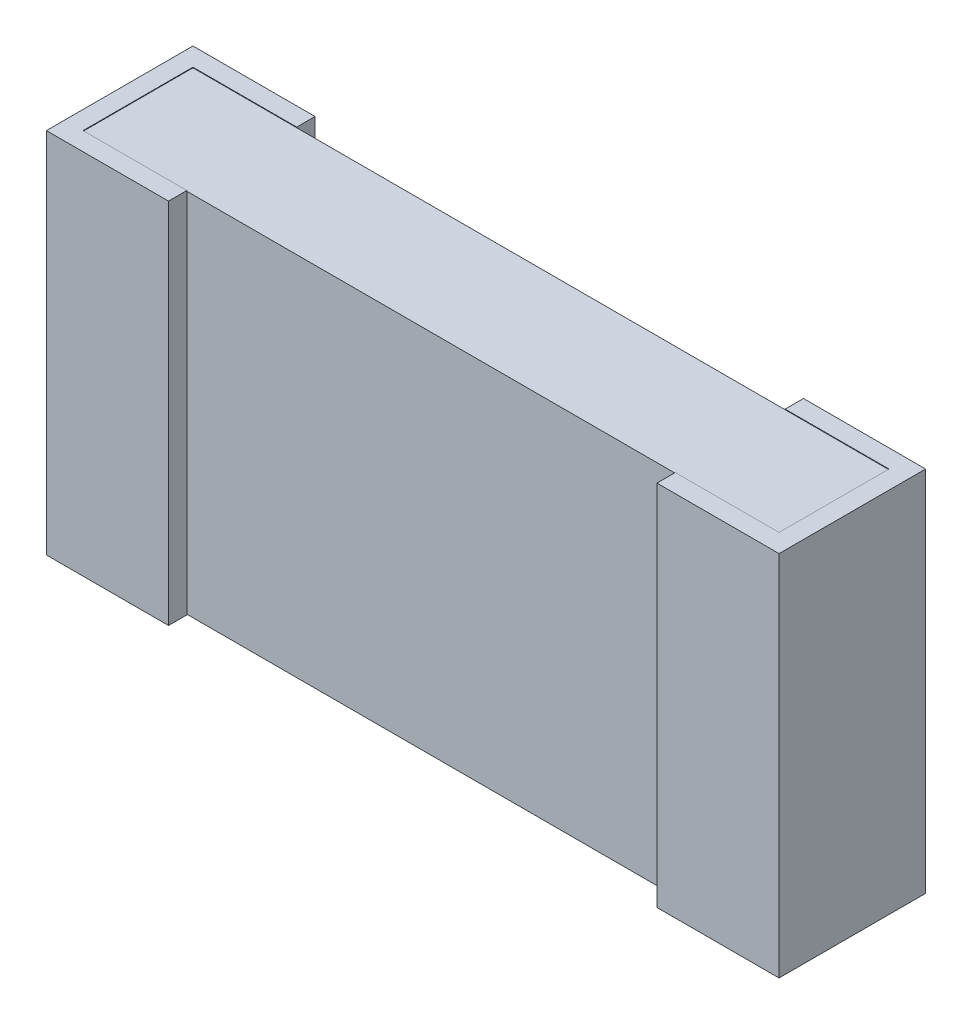
ISO-10303-21;
HEADER;
FILE_DESCRIPTION(('STEP AP214'),'2;1');
FILE_NAME('part.step','',(''),(''),'','','');
FILE_SCHEMA(('AUTOMOTIVE_DESIGN { 1 0 10303 214 1 1 1 1 }'));
ENDSEC;
DATA;
#1=APPLICATION_CONTEXT('core data for automotive mechanical design processes');
#2=APPLICATION_PROTOCOL_DEFINITION('international standard','automotive_design',2000,#1);
#3=PRODUCT_CONTEXT('',#1,'mechanical');
#4=PRODUCT('Part','Part','',(#3));
#5=PRODUCT_RELATED_PRODUCT_CATEGORY('part','',(#4));
#6=PRODUCT_DEFINITION_FORMATION('','',#4);
#7=PRODUCT_DEFINITION_CONTEXT('part definition',#1,'design');
#8=PRODUCT_DEFINITION('design','',#6,#7);
#9=PRODUCT_DEFINITION_SHAPE('','',#8);
#10=(LENGTH_UNIT() NAMED_UNIT(*) SI_UNIT(.MILLI.,.METRE.));
#11=(NAMED_UNIT(*) PLANE_ANGLE_UNIT() SI_UNIT($,.RADIAN.));
#12=(NAMED_UNIT(*) SI_UNIT($,.STERADIAN.) SOLID_ANGLE_UNIT());
#13=UNCERTAINTY_MEASURE_WITH_UNIT(LENGTH_MEASURE(1.E-05),#10,'distance_accuracy_value','');
#14=(GEOMETRIC_REPRESENTATION_CONTEXT(3) GLOBAL_UNCERTAINTY_ASSIGNED_CONTEXT((#13)) GLOBAL_UNIT_ASSIGNED_CONTEXT((#10,
#11,#12)) REPRESENTATION_CONTEXT('',''));
#15=CARTESIAN_POINT('',(0.,0.,0.));
#16=DIRECTION('',(0.,0.,1.));
#17=DIRECTION('',(1.,0.,0.));
#18=AXIS2_PLACEMENT_3D('',#15,#16,#17);
#19=CARTESIAN_POINT('',(0.0762,0.762,0.533400000000122));
#20=DIRECTION('',(0.,0.,-1.));
#21=DIRECTION('',(-1.,0.,0.));
#22=AXIS2_PLACEMENT_3D('',#19,#20,#21);
#23=PLANE('',#22);
#24=DIRECTION('',(0.,1.,0.));
#25=VECTOR('',#24,1.);
#26=CARTESIAN_POINT('',(2.54000000000002,-0.76454,0.533400000000122));
#27=LINE('',#26,#25);
#28=CARTESIAN_POINT('',(2.54000000000001,-0.762,0.533400000000122));
#29=VERTEX_POINT('',#28);
#30=CARTESIAN_POINT('',(2.54000000000001,0.762,0.533400000000122));
#31=VERTEX_POINT('',#30);
#32=EDGE_CURVE('E53',#29,#31,#27,.T.);
#33=ORIENTED_EDGE('',*,*,#32,.T.);
#34=DIRECTION('',(1.,0.,0.));
#35=VECTOR('',#34,1.);
#36=CARTESIAN_POINT('',(0.0762,0.762,0.533400000000122));
#37=LINE('',#36,#35);
#38=CARTESIAN_POINT('',(0.507999999999976,0.762,0.533400000000122));
#39=VERTEX_POINT('',#38);
#40=EDGE_CURVE('E38',#39,#31,#37,.T.);
#41=ORIENTED_EDGE('',*,*,#40,.F.);
#42=DIRECTION('',(0.,1.,0.));
#43=VECTOR('',#42,1.);
#44=CARTESIAN_POINT('',(0.507999999999976,-0.76454,0.533400000000122));
#45=LINE('',#44,#43);
#46=CARTESIAN_POINT('',(0.507999999999976,-0.762,0.533400000000122));
#47=VERTEX_POINT('',#46);
#48=EDGE_CURVE('E349',#47,#39,#45,.T.);
#49=ORIENTED_EDGE('',*,*,#48,.F.);
#50=DIRECTION('',(1.,0.,0.));
#51=VECTOR('',#50,1.);
#52=CARTESIAN_POINT('',(0.0762,-0.762,0.533400000000122));
#53=LINE('',#52,#51);
#54=EDGE_CURVE('E366',#47,#29,#53,.T.);
#55=ORIENTED_EDGE('',*,*,#54,.T.);
#56=EDGE_LOOP('',(#33,#41,#49,#55));
#57=FACE_BOUND('',#56,.T.);
#58=ADVANCED_FACE('F30',(#57),#23,.F.);
#59=CARTESIAN_POINT('',(2.9718,0.762,0.0762000000001228));
#60=DIRECTION('',(0.,0.,1.));
#61=DIRECTION('',(1.,0.,0.));
#62=AXIS2_PLACEMENT_3D('',#59,#60,#61);
#63=PLANE('',#62);
#64=DIRECTION('',(0.,1.,0.));
#65=VECTOR('',#64,1.);
#66=CARTESIAN_POINT('',(2.54,-0.76454,0.0762000000001224));
#67=LINE('',#66,#65);
#68=CARTESIAN_POINT('',(2.54,-0.762,0.0762000000001224));
#69=VERTEX_POINT('',#68);
#70=CARTESIAN_POINT('',(2.54000000000001,0.762,0.0762000000001224));
#71=VERTEX_POINT('',#70);
#72=EDGE_CURVE('E273',#69,#71,#67,.T.);
#73=ORIENTED_EDGE('',*,*,#72,.F.);
#74=DIRECTION('',(-1.,0.,0.));
#75=VECTOR('',#74,1.);
#76=CARTESIAN_POINT('',(2.9718,-0.762,0.0762000000001228));
#77=LINE('',#76,#75);
#78=CARTESIAN_POINT('',(0.508,-0.762,0.0762000000001224));
#79=VERTEX_POINT('',#78);
#80=EDGE_CURVE('E360',#69,#79,#77,.T.);
#81=ORIENTED_EDGE('',*,*,#80,.T.);
#82=DIRECTION('',(0.,1.,0.));
#83=VECTOR('',#82,1.);
#84=CARTESIAN_POINT('',(0.508,-0.76454,0.0762000000001224));
#85=LINE('',#84,#83);
#86=CARTESIAN_POINT('',(0.508,0.762,0.0762000000001224));
#87=VERTEX_POINT('',#86);
#88=EDGE_CURVE('E336',#79,#87,#85,.T.);
#89=ORIENTED_EDGE('',*,*,#88,.T.);
#90=DIRECTION('',(-1.,0.,0.));
#91=VECTOR('',#90,1.);
#92=CARTESIAN_POINT('',(2.9718,0.762,0.0762000000001228));
#93=LINE('',#92,#91);
#94=EDGE_CURVE('E45',#71,#87,#93,.T.);
#95=ORIENTED_EDGE('',*,*,#94,.F.);
#96=EDGE_LOOP('',(#73,#81,#89,#95));
#97=FACE_BOUND('',#96,.T.);
#98=ADVANCED_FACE('F32',(#97),#63,.F.);
#99=CARTESIAN_POINT('',(0.0762000000000002,0.762,0.0762000000001225));
#100=DIRECTION('',(0.,1.,0.));
#101=DIRECTION('',(0.,0.,1.));
#102=AXIS2_PLACEMENT_3D('',#99,#100,#101);
#103=PLANE('',#102);
#104=DIRECTION('',(0.,0.,-1.));
#105=VECTOR('',#104,1.);
#106=CARTESIAN_POINT('',(0.0762,0.762,0.533400000000122));
#107=LINE('',#106,#105);
#108=CARTESIAN_POINT('',(0.0762,0.762,0.533400000000122));
#109=VERTEX_POINT('',#108);
#110=CARTESIAN_POINT('',(0.0762000000000002,0.762,0.0762000000001224));
#111=VERTEX_POINT('',#110);
#112=EDGE_CURVE('E365',#109,#111,#107,.T.);
#113=ORIENTED_EDGE('',*,*,#112,.F.);
#114=EDGE_CURVE('E11',#109,#39,#37,.T.);
#115=ORIENTED_EDGE('',*,*,#114,.T.);
#116=ORIENTED_EDGE('',*,*,#40,.T.);
#117=DIRECTION('',(-1.,0.,0.));
#118=VECTOR('',#117,1.);
#119=CARTESIAN_POINT('',(0.0762000000000002,0.762,0.533400000000122));
#120=LINE('',#119,#118);
#121=CARTESIAN_POINT('',(2.9718,0.762,0.533400000000122));
#122=VERTEX_POINT('',#121);
#123=EDGE_CURVE('E277',#122,#31,#120,.T.);
#124=ORIENTED_EDGE('',*,*,#123,.F.);
#125=DIRECTION('',(0.,0.,1.));
#126=VECTOR('',#125,1.);
#127=CARTESIAN_POINT('',(2.9718,0.762,0.0762000000001228));
#128=LINE('',#127,#126);
#129=CARTESIAN_POINT('',(2.9718,0.762,0.0762000000001228));
#130=VERTEX_POINT('',#129);
#131=EDGE_CURVE('E202',#130,#122,#128,.T.);
#132=ORIENTED_EDGE('',*,*,#131,.F.);
#133=EDGE_CURVE('E368',#130,#71,#93,.T.);
#134=ORIENTED_EDGE('',*,*,#133,.T.);
#135=ORIENTED_EDGE('',*,*,#94,.T.);
#136=DIRECTION('',(-1.,0.,0.));
#137=VECTOR('',#136,1.);
#138=CARTESIAN_POINT('',(0.0762000000000002,0.762,0.0762000000001224));
#139=LINE('',#138,#137);
#140=EDGE_CURVE('E348',#87,#111,#139,.T.);
#141=ORIENTED_EDGE('',*,*,#140,.T.);
#142=EDGE_LOOP('',(#113,#115,#116,#124,#132,#134,#135,#141));
#143=FACE_BOUND('',#142,.T.);
#144=ADVANCED_FACE('F371',(#143),#103,.T.);
#145=CARTESIAN_POINT('',(0.0762000000000002,-0.762,0.0762000000001225));
#146=DIRECTION('',(0.,1.,0.));
#147=DIRECTION('',(0.,0.,1.));
#148=AXIS2_PLACEMENT_3D('',#145,#146,#147);
#149=PLANE('',#148);
#150=DIRECTION('',(0.,0.,-1.));
#151=VECTOR('',#150,1.);
#152=CARTESIAN_POINT('',(0.0762,-0.762,0.533400000000122));
#153=LINE('',#152,#151);
#154=CARTESIAN_POINT('',(0.0762,-0.762,0.533400000000122));
#155=VERTEX_POINT('',#154);
#156=CARTESIAN_POINT('',(0.0762000000000002,-0.762,0.0762000000001225));
#157=VERTEX_POINT('',#156);
#158=EDGE_CURVE('E352',#155,#157,#153,.T.);
#159=ORIENTED_EDGE('',*,*,#158,.T.);
#160=EDGE_CURVE('E355',#79,#157,#77,.T.);
#161=ORIENTED_EDGE('',*,*,#160,.F.);
#162=ORIENTED_EDGE('',*,*,#80,.F.);
#163=CARTESIAN_POINT('',(2.9718,-0.762,0.0762000000001228));
#164=VERTEX_POINT('',#163);
#165=EDGE_CURVE('E356',#164,#69,#77,.T.);
#166=ORIENTED_EDGE('',*,*,#165,.F.);
#167=DIRECTION('',(0.,0.,1.));
#168=VECTOR('',#167,1.);
#169=CARTESIAN_POINT('',(2.9718,-0.762,0.0762000000001228));
#170=LINE('',#169,#168);
#171=CARTESIAN_POINT('',(2.9718,-0.762,0.533400000000122));
#172=VERTEX_POINT('',#171);
#173=EDGE_CURVE('E359',#164,#172,#170,.T.);
#174=ORIENTED_EDGE('',*,*,#173,.T.);
#175=EDGE_CURVE('E362',#29,#172,#53,.T.);
#176=ORIENTED_EDGE('',*,*,#175,.F.);
#177=ORIENTED_EDGE('',*,*,#54,.F.);
#178=EDGE_CURVE('E363',#155,#47,#53,.T.);
#179=ORIENTED_EDGE('',*,*,#178,.F.);
#180=EDGE_LOOP('',(#159,#161,#162,#166,#174,#176,#177,#179));
#181=FACE_BOUND('',#180,.T.);
#182=ADVANCED_FACE('F418',(#181),#149,.F.);
#183=CARTESIAN_POINT('',(0.0762,-0.76454,0.533400000000122));
#184=DIRECTION('',(0.,0.,1.));
#185=DIRECTION('',(1.,0.,0.));
#186=AXIS2_PLACEMENT_3D('',#183,#184,#185);
#187=PLANE('',#186);
#188=DIRECTION('',(0.,1.,0.));
#189=VECTOR('',#188,1.);
#190=CARTESIAN_POINT('',(0.0762,-0.76454,0.533400000000122));
#191=LINE('',#190,#189);
#192=CARTESIAN_POINT('',(0.0762,-0.76454,0.533400000000122));
#193=VERTEX_POINT('',#192);
#194=EDGE_CURVE('E325',#193,#155,#191,.T.);
#195=ORIENTED_EDGE('',*,*,#194,.T.);
#196=ORIENTED_EDGE('',*,*,#178,.T.);
#197=CARTESIAN_POINT('',(0.507999999999976,-0.76454,0.533400000000122));
#198=VERTEX_POINT('',#197);
#199=EDGE_CURVE('E345',#198,#47,#45,.T.);
#200=ORIENTED_EDGE('',*,*,#199,.F.);
#201=DIRECTION('',(1.,0.,0.));
#202=VECTOR('',#201,1.);
#203=CARTESIAN_POINT('',(0.0762,-0.76454,0.533400000000122));
#204=LINE('',#203,#202);
#205=EDGE_CURVE('E303',#193,#198,#204,.T.);
#206=ORIENTED_EDGE('',*,*,#205,.F.);
#207=EDGE_LOOP('',(#195,#196,#200,#206));
#208=FACE_BOUND('',#207,.T.);
#209=ADVANCED_FACE('F425',(#208),#187,.F.);
#210=CARTESIAN_POINT('',(0.508,-0.76454,0.0762000000001224));
#211=DIRECTION('',(0.,0.,-1.));
#212=DIRECTION('',(-1.,0.,0.));
#213=AXIS2_PLACEMENT_3D('',#210,#211,#212);
#214=PLANE('',#213);
#215=CARTESIAN_POINT('',(0.508,-0.76454,0.0762000000001224));
#216=VERTEX_POINT('',#215);
#217=EDGE_CURVE('E332',#216,#79,#85,.T.);
#218=ORIENTED_EDGE('',*,*,#217,.T.);
#219=ORIENTED_EDGE('',*,*,#160,.T.);
#220=DIRECTION('',(0.,1.,0.));
#221=VECTOR('',#220,1.);
#222=CARTESIAN_POINT('',(0.0762000000000002,-0.76454,0.0762000000001224));
#223=LINE('',#222,#221);
#224=CARTESIAN_POINT('',(0.0762000000000002,-0.76454,0.0762000000001224));
#225=VERTEX_POINT('',#224);
#226=EDGE_CURVE('E329',#225,#157,#223,.T.);
#227=ORIENTED_EDGE('',*,*,#226,.F.);
#228=DIRECTION('',(-1.,0.,0.));
#229=VECTOR('',#228,1.);
#230=CARTESIAN_POINT('',(0.508,-0.76454,0.0762000000001224));
#231=LINE('',#230,#229);
#232=EDGE_CURVE('E320',#216,#225,#231,.T.);
#233=ORIENTED_EDGE('',*,*,#232,.F.);
#234=EDGE_LOOP('',(#218,#219,#227,#233));
#235=FACE_BOUND('',#234,.T.);
#236=ADVANCED_FACE('F414',(#235),#214,.F.);
#237=CARTESIAN_POINT('',(0.0762000000000002,-0.76454,0.0762000000001224));
#238=DIRECTION('',(-1.,0.,0.));
#239=DIRECTION('',(0.,0.,1.));
#240=AXIS2_PLACEMENT_3D('',#237,#238,#239);
#241=PLANE('',#240);
#242=ORIENTED_EDGE('',*,*,#226,.T.);
#243=ORIENTED_EDGE('',*,*,#158,.F.);
#244=ORIENTED_EDGE('',*,*,#194,.F.);
#245=DIRECTION('',(0.,0.,1.));
#246=VECTOR('',#245,1.);
#247=CARTESIAN_POINT('',(0.0762000000000002,-0.76454,0.0762000000001224));
#248=LINE('',#247,#246);
#249=EDGE_CURVE('E322',#225,#193,#248,.T.);
#250=ORIENTED_EDGE('',*,*,#249,.F.);
#251=EDGE_LOOP('',(#242,#243,#244,#250));
#252=FACE_BOUND('',#251,.T.);
#253=ADVANCED_FACE('F422',(#252),#241,.F.);
#254=ORIENTED_EDGE('',*,*,#114,.F.);
#255=CARTESIAN_POINT('',(0.0762,0.76454,0.533400000000122));
#256=VERTEX_POINT('',#255);
#257=EDGE_CURVE('E324',#109,#256,#191,.T.);
#258=ORIENTED_EDGE('',*,*,#257,.T.);
#259=DIRECTION('',(1.,0.,0.));
#260=VECTOR('',#259,1.);
#261=CARTESIAN_POINT('',(0.0762,0.76454,0.533400000000122));
#262=LINE('',#261,#260);
#263=CARTESIAN_POINT('',(0.507999999999976,0.76454,0.533400000000122));
#264=VERTEX_POINT('',#263);
#265=EDGE_CURVE('E279',#256,#264,#262,.T.);
#266=ORIENTED_EDGE('',*,*,#265,.T.);
#267=EDGE_CURVE('E344',#39,#264,#45,.T.);
#268=ORIENTED_EDGE('',*,*,#267,.F.);
#269=EDGE_LOOP('',(#254,#258,#266,#268));
#270=FACE_BOUND('',#269,.T.);
#271=ADVANCED_FACE('F446',(#270),#187,.F.);
#272=CARTESIAN_POINT('',(0.508,-0.76454,0.609599999999878));
#273=DIRECTION('',(1.,0.,-3.08755736784921E-13));
#274=DIRECTION('',(-3.08755736784921E-13,0.,-1.));
#275=AXIS2_PLACEMENT_3D('',#272,#273,#274);
#276=PLANE('',#275);
#277=DIRECTION('',(-3.08755736784921E-13,0.,-1.));
#278=VECTOR('',#277,1.);
#279=CARTESIAN_POINT('',(0.508,0.76454,0.609599999999878));
#280=LINE('',#279,#278);
#281=CARTESIAN_POINT('',(0.508,0.76454,0.609599999999878));
#282=VERTEX_POINT('',#281);
#283=EDGE_CURVE('E282',#282,#264,#280,.T.);
#284=ORIENTED_EDGE('',*,*,#283,.F.);
#285=DIRECTION('',(0.,1.,0.));
#286=VECTOR('',#285,1.);
#287=CARTESIAN_POINT('',(0.508,-0.76454,0.609599999999878));
#288=LINE('',#287,#286);
#289=CARTESIAN_POINT('',(0.508,-0.76454,0.609599999999878));
#290=VERTEX_POINT('',#289);
#291=EDGE_CURVE('E342',#290,#282,#288,.T.);
#292=ORIENTED_EDGE('',*,*,#291,.F.);
#293=DIRECTION('',(-3.08755736784921E-13,0.,-1.));
#294=VECTOR('',#293,1.);
#295=CARTESIAN_POINT('',(0.508,-0.76454,0.609599999999878));
#296=LINE('',#295,#294);
#297=EDGE_CURVE('E305',#290,#198,#296,.T.);
#298=ORIENTED_EDGE('',*,*,#297,.T.);
#299=ORIENTED_EDGE('',*,*,#199,.T.);
#300=ORIENTED_EDGE('',*,*,#48,.T.);
#301=ORIENTED_EDGE('',*,*,#267,.T.);
#302=EDGE_LOOP('',(#284,#292,#298,#299,#300,#301));
#303=FACE_BOUND('',#302,.T.);
#304=ADVANCED_FACE('F450',(#303),#276,.T.);
#305=CARTESIAN_POINT('',(0.,-0.76454,0.609599999999878));
#306=DIRECTION('',(0.,0.,1.));
#307=DIRECTION('',(1.,0.,0.));
#308=AXIS2_PLACEMENT_3D('',#305,#306,#307);
#309=PLANE('',#308);
#310=DIRECTION('',(1.,0.,0.));
#311=VECTOR('',#310,1.);
#312=CARTESIAN_POINT('',(0.,0.76454,0.609599999999878));
#313=LINE('',#312,#311);
#314=CARTESIAN_POINT('',(0.,0.76454,0.609599999999878));
#315=VERTEX_POINT('',#314);
#316=EDGE_CURVE('E285',#315,#282,#313,.T.);
#317=ORIENTED_EDGE('',*,*,#316,.F.);
#318=DIRECTION('',(0.,1.,0.));
#319=VECTOR('',#318,1.);
#320=CARTESIAN_POINT('',(0.,-0.76454,0.609599999999878));
#321=LINE('',#320,#319);
#322=CARTESIAN_POINT('',(0.,-0.76454,0.609599999999878));
#323=VERTEX_POINT('',#322);
#324=EDGE_CURVE('E340',#323,#315,#321,.T.);
#325=ORIENTED_EDGE('',*,*,#324,.F.);
#326=DIRECTION('',(1.,0.,0.));
#327=VECTOR('',#326,1.);
#328=CARTESIAN_POINT('',(0.,-0.76454,0.609599999999878));
#329=LINE('',#328,#327);
#330=EDGE_CURVE('E308',#323,#290,#329,.T.);
#331=ORIENTED_EDGE('',*,*,#330,.T.);
#332=ORIENTED_EDGE('',*,*,#291,.T.);
#333=EDGE_LOOP('',(#317,#325,#331,#332));
#334=FACE_BOUND('',#333,.T.);
#335=ADVANCED_FACE('F487',(#334),#309,.T.);
#336=CARTESIAN_POINT('',(0.,-0.76454,0.));
#337=DIRECTION('',(-1.,0.,0.));
#338=DIRECTION('',(0.,0.,1.));
#339=AXIS2_PLACEMENT_3D('',#336,#337,#338);
#340=PLANE('',#339);
#341=DIRECTION('',(0.,0.,1.));
#342=VECTOR('',#341,1.);
#343=CARTESIAN_POINT('',(0.,0.76454,0.));
#344=LINE('',#343,#342);
#345=CARTESIAN_POINT('',(0.,0.76454,0.));
#346=VERTEX_POINT('',#345);
#347=EDGE_CURVE('E288',#346,#315,#344,.T.);
#348=ORIENTED_EDGE('',*,*,#347,.F.);
#349=DIRECTION('',(0.,1.,0.));
#350=VECTOR('',#349,1.);
#351=CARTESIAN_POINT('',(0.,-0.76454,0.));
#352=LINE('',#351,#350);
#353=CARTESIAN_POINT('',(0.,-0.76454,0.));
#354=VERTEX_POINT('',#353);
#355=EDGE_CURVE('E338',#354,#346,#352,.T.);
#356=ORIENTED_EDGE('',*,*,#355,.F.);
#357=DIRECTION('',(0.,0.,1.));
#358=VECTOR('',#357,1.);
#359=CARTESIAN_POINT('',(0.,-0.76454,0.));
#360=LINE('',#359,#358);
#361=EDGE_CURVE('E311',#354,#323,#360,.T.);
#362=ORIENTED_EDGE('',*,*,#361,.T.);
#363=ORIENTED_EDGE('',*,*,#324,.T.);
#364=EDGE_LOOP('',(#348,#356,#362,#363));
#365=FACE_BOUND('',#364,.T.);
#366=ADVANCED_FACE('F490',(#365),#340,.T.);
#367=CARTESIAN_POINT('',(0.507999999999976,-0.76454,0.));
#368=DIRECTION('',(0.,0.,-1.));
#369=DIRECTION('',(-1.,0.,0.));
#370=AXIS2_PLACEMENT_3D('',#367,#368,#369);
#371=PLANE('',#370);
#372=DIRECTION('',(-1.,0.,0.));
#373=VECTOR('',#372,1.);
#374=CARTESIAN_POINT('',(0.507999999999976,0.76454,0.));
#375=LINE('',#374,#373);
#376=CARTESIAN_POINT('',(0.507999999999976,0.76454,0.));
#377=VERTEX_POINT('',#376);
#378=EDGE_CURVE('E291',#377,#346,#375,.T.);
#379=ORIENTED_EDGE('',*,*,#378,.F.);
#380=DIRECTION('',(0.,1.,0.));
#381=VECTOR('',#380,1.);
#382=CARTESIAN_POINT('',(0.507999999999976,-0.76454,0.));
#383=LINE('',#382,#381);
#384=CARTESIAN_POINT('',(0.507999999999976,-0.76454,0.));
#385=VERTEX_POINT('',#384);
#386=EDGE_CURVE('E335',#385,#377,#383,.T.);
#387=ORIENTED_EDGE('',*,*,#386,.F.);
#388=DIRECTION('',(-1.,0.,0.));
#389=VECTOR('',#388,1.);
#390=CARTESIAN_POINT('',(0.507999999999976,-0.76454,0.));
#391=LINE('',#390,#389);
#392=EDGE_CURVE('E314',#385,#354,#391,.T.);
#393=ORIENTED_EDGE('',*,*,#392,.T.);
#394=ORIENTED_EDGE('',*,*,#355,.T.);
#395=EDGE_LOOP('',(#379,#387,#393,#394));
#396=FACE_BOUND('',#395,.T.);
#397=ADVANCED_FACE('F436',(#396),#371,.T.);
#398=CARTESIAN_POINT('',(0.508,-0.76454,0.0762000000001224));
#399=DIRECTION('',(1.,0.,-3.10178574280132E-13));
#400=DIRECTION('',(-3.10178574280132E-13,0.,-1.));
#401=AXIS2_PLACEMENT_3D('',#398,#399,#400);
#402=PLANE('',#401);
#403=DIRECTION('',(-3.10178574280132E-13,0.,-1.));
#404=VECTOR('',#403,1.);
#405=CARTESIAN_POINT('',(0.508,0.76454,0.0762000000001224));
#406=LINE('',#405,#404);
#407=CARTESIAN_POINT('',(0.508,0.76454,0.0762000000001224));
#408=VERTEX_POINT('',#407);
#409=EDGE_CURVE('E294',#408,#377,#406,.T.);
#410=ORIENTED_EDGE('',*,*,#409,.F.);
#411=EDGE_CURVE('E331',#87,#408,#85,.T.);
#412=ORIENTED_EDGE('',*,*,#411,.F.);
#413=ORIENTED_EDGE('',*,*,#88,.F.);
#414=ORIENTED_EDGE('',*,*,#217,.F.);
#415=DIRECTION('',(-3.10178574280132E-13,0.,-1.));
#416=VECTOR('',#415,1.);
#417=CARTESIAN_POINT('',(0.508,-0.76454,0.0762000000001224));
#418=LINE('',#417,#416);
#419=EDGE_CURVE('E317',#216,#385,#418,.T.);
#420=ORIENTED_EDGE('',*,*,#419,.T.);
#421=ORIENTED_EDGE('',*,*,#386,.T.);
#422=EDGE_LOOP('',(#410,#412,#413,#414,#420,#421));
#423=FACE_BOUND('',#422,.T.);
#424=ADVANCED_FACE('F408',(#423),#402,.T.);
#425=ORIENTED_EDGE('',*,*,#140,.F.);
#426=ORIENTED_EDGE('',*,*,#411,.T.);
#427=DIRECTION('',(-1.,0.,0.));
#428=VECTOR('',#427,1.);
#429=CARTESIAN_POINT('',(0.508,0.76454,0.0762000000001224));
#430=LINE('',#429,#428);
#431=CARTESIAN_POINT('',(0.0762000000000002,0.76454,0.0762000000001224));
#432=VERTEX_POINT('',#431);
#433=EDGE_CURVE('E297',#408,#432,#430,.T.);
#434=ORIENTED_EDGE('',*,*,#433,.T.);
#435=EDGE_CURVE('E328',#111,#432,#223,.T.);
#436=ORIENTED_EDGE('',*,*,#435,.F.);
#437=EDGE_LOOP('',(#425,#426,#434,#436));
#438=FACE_BOUND('',#437,.T.);
#439=ADVANCED_FACE('F403',(#438),#214,.F.);
#440=ORIENTED_EDGE('',*,*,#112,.T.);
#441=ORIENTED_EDGE('',*,*,#435,.T.);
#442=DIRECTION('',(0.,0.,1.));
#443=VECTOR('',#442,1.);
#444=CARTESIAN_POINT('',(0.0762000000000002,0.76454,0.0762000000001224));
#445=LINE('',#444,#443);
#446=EDGE_CURVE('E300',#432,#256,#445,.T.);
#447=ORIENTED_EDGE('',*,*,#446,.T.);
#448=ORIENTED_EDGE('',*,*,#257,.F.);
#449=EDGE_LOOP('',(#440,#441,#447,#448));
#450=FACE_BOUND('',#449,.T.);
#451=ADVANCED_FACE('F444',(#450),#241,.F.);
#452=CARTESIAN_POINT('',(0.,-0.76454,0.533400000000122));
#453=DIRECTION('',(0.,-1.,0.));
#454=DIRECTION('',(0.,0.,-1.));
#455=AXIS2_PLACEMENT_3D('',#452,#453,#454);
#456=PLANE('',#455);
#457=ORIENTED_EDGE('',*,*,#205,.T.);
#458=ORIENTED_EDGE('',*,*,#297,.F.);
#459=ORIENTED_EDGE('',*,*,#330,.F.);
#460=ORIENTED_EDGE('',*,*,#361,.F.);
#461=ORIENTED_EDGE('',*,*,#392,.F.);
#462=ORIENTED_EDGE('',*,*,#419,.F.);
#463=ORIENTED_EDGE('',*,*,#232,.T.);
#464=ORIENTED_EDGE('',*,*,#249,.T.);
#465=EDGE_LOOP('',(#457,#458,#459,#460,#461,#462,#463,#464));
#466=FACE_BOUND('',#465,.T.);
#467=ADVANCED_FACE('F429',(#466),#456,.T.);
#468=CARTESIAN_POINT('',(0.,0.76454,0.533400000000122));
#469=DIRECTION('',(0.,-1.,0.));
#470=DIRECTION('',(0.,0.,-1.));
#471=AXIS2_PLACEMENT_3D('',#468,#469,#470);
#472=PLANE('',#471);
#473=ORIENTED_EDGE('',*,*,#265,.F.);
#474=ORIENTED_EDGE('',*,*,#446,.F.);
#475=ORIENTED_EDGE('',*,*,#433,.F.);
#476=ORIENTED_EDGE('',*,*,#409,.T.);
#477=ORIENTED_EDGE('',*,*,#378,.T.);
#478=ORIENTED_EDGE('',*,*,#347,.T.);
#479=ORIENTED_EDGE('',*,*,#316,.T.);
#480=ORIENTED_EDGE('',*,*,#283,.T.);
#481=EDGE_LOOP('',(#473,#474,#475,#476,#477,#478,#479,#480));
#482=FACE_BOUND('',#481,.T.);
#483=ADVANCED_FACE('F440',(#482),#472,.F.);
#484=CARTESIAN_POINT('',(2.9718,-0.76454,0.533400000000122));
#485=DIRECTION('',(0.,0.,-1.));
#486=DIRECTION('',(-1.,0.,0.));
#487=AXIS2_PLACEMENT_3D('',#484,#485,#486);
#488=PLANE('',#487);
#489=ORIENTED_EDGE('',*,*,#175,.T.);
#490=DIRECTION('',(0.,1.,0.));
#491=VECTOR('',#490,1.);
#492=CARTESIAN_POINT('',(2.9718,-0.76454,0.533400000000122));
#493=LINE('',#492,#491);
#494=CARTESIAN_POINT('',(2.9718,-0.76454,0.533400000000122));
#495=VERTEX_POINT('',#494);
#496=EDGE_CURVE('E205',#495,#172,#493,.T.);
#497=ORIENTED_EDGE('',*,*,#496,.F.);
#498=DIRECTION('',(-1.,0.,0.));
#499=VECTOR('',#498,1.);
#500=CARTESIAN_POINT('',(2.9718,-0.76454,0.533400000000122));
#501=LINE('',#500,#499);
#502=CARTESIAN_POINT('',(2.54000000000002,-0.76454,0.533400000000122));
#503=VERTEX_POINT('',#502);
#504=EDGE_CURVE('E234',#495,#503,#501,.T.);
#505=ORIENTED_EDGE('',*,*,#504,.T.);
#506=EDGE_CURVE('E253',#503,#29,#27,.T.);
#507=ORIENTED_EDGE('',*,*,#506,.T.);
#508=EDGE_LOOP('',(#489,#497,#505,#507));
#509=FACE_BOUND('',#508,.T.);
#510=ADVANCED_FACE('F453',(#509),#488,.T.);
#511=CARTESIAN_POINT('',(2.9718,-0.76454,0.0762000000001224));
#512=DIRECTION('',(-1.,0.,0.));
#513=DIRECTION('',(0.,0.,1.));
#514=AXIS2_PLACEMENT_3D('',#511,#512,#513);
#515=PLANE('',#514);
#516=ORIENTED_EDGE('',*,*,#173,.F.);
#517=DIRECTION('',(0.,1.,0.));
#518=VECTOR('',#517,1.);
#519=CARTESIAN_POINT('',(2.9718,-0.76454,0.0762000000001224));
#520=LINE('',#519,#518);
#521=CARTESIAN_POINT('',(2.9718,-0.76454,0.0762000000001224));
#522=VERTEX_POINT('',#521);
#523=EDGE_CURVE('E206',#522,#164,#520,.T.);
#524=ORIENTED_EDGE('',*,*,#523,.F.);
#525=DIRECTION('',(0.,0.,1.));
#526=VECTOR('',#525,1.);
#527=CARTESIAN_POINT('',(2.9718,-0.76454,0.0762000000001224));
#528=LINE('',#527,#526);
#529=EDGE_CURVE('E237',#522,#495,#528,.T.);
#530=ORIENTED_EDGE('',*,*,#529,.T.);
#531=ORIENTED_EDGE('',*,*,#496,.T.);
#532=EDGE_LOOP('',(#516,#524,#530,#531));
#533=FACE_BOUND('',#532,.T.);
#534=ADVANCED_FACE('F457',(#533),#515,.T.);
#535=CARTESIAN_POINT('',(2.54,-0.76454,0.0762000000001224));
#536=DIRECTION('',(0.,0.,1.));
#537=DIRECTION('',(1.,0.,0.));
#538=AXIS2_PLACEMENT_3D('',#535,#536,#537);
#539=PLANE('',#538);
#540=ORIENTED_EDGE('',*,*,#165,.T.);
#541=CARTESIAN_POINT('',(2.54,-0.76454,0.0762000000001224));
#542=VERTEX_POINT('',#541);
#543=EDGE_CURVE('E269',#542,#69,#67,.T.);
#544=ORIENTED_EDGE('',*,*,#543,.F.);
#545=DIRECTION('',(1.,0.,0.));
#546=VECTOR('',#545,1.);
#547=CARTESIAN_POINT('',(2.54,-0.76454,0.0762000000001224));
#548=LINE('',#547,#546);
#549=EDGE_CURVE('E240',#542,#522,#548,.T.);
#550=ORIENTED_EDGE('',*,*,#549,.T.);
#551=ORIENTED_EDGE('',*,*,#523,.T.);
#552=EDGE_LOOP('',(#540,#544,#550,#551));
#553=FACE_BOUND('',#552,.T.);
#554=ADVANCED_FACE('F463',(#553),#539,.T.);
#555=CARTESIAN_POINT('',(2.9718,0.76454,0.533400000000122));
#556=VERTEX_POINT('',#555);
#557=EDGE_CURVE('E195',#122,#556,#493,.T.);
#558=ORIENTED_EDGE('',*,*,#557,.F.);
#559=ORIENTED_EDGE('',*,*,#123,.T.);
#560=CARTESIAN_POINT('',(2.54000000000002,0.76454,0.533400000000122));
#561=VERTEX_POINT('',#560);
#562=EDGE_CURVE('E212',#31,#561,#27,.T.);
#563=ORIENTED_EDGE('',*,*,#562,.T.);
#564=DIRECTION('',(-1.,0.,0.));
#565=VECTOR('',#564,1.);
#566=CARTESIAN_POINT('',(2.9718,0.76454,0.533400000000122));
#567=LINE('',#566,#565);
#568=EDGE_CURVE('E209',#556,#561,#567,.T.);
#569=ORIENTED_EDGE('',*,*,#568,.F.);
#570=EDGE_LOOP('',(#558,#559,#563,#569));
#571=FACE_BOUND('',#570,.T.);
#572=ADVANCED_FACE('F210',(#571),#488,.T.);
#573=CARTESIAN_POINT('',(2.9718,0.76454,0.0762000000001224));
#574=VERTEX_POINT('',#573);
#575=EDGE_CURVE('E272',#130,#574,#520,.T.);
#576=ORIENTED_EDGE('',*,*,#575,.F.);
#577=ORIENTED_EDGE('',*,*,#131,.T.);
#578=ORIENTED_EDGE('',*,*,#557,.T.);
#579=DIRECTION('',(0.,0.,1.));
#580=VECTOR('',#579,1.);
#581=CARTESIAN_POINT('',(2.9718,0.76454,0.0762000000001224));
#582=LINE('',#581,#580);
#583=EDGE_CURVE('E200',#574,#556,#582,.T.);
#584=ORIENTED_EDGE('',*,*,#583,.F.);
#585=EDGE_LOOP('',(#576,#577,#578,#584));
#586=FACE_BOUND('',#585,.T.);
#587=ADVANCED_FACE('F198',(#586),#515,.T.);
#588=CARTESIAN_POINT('',(2.54,0.76454,0.0762000000001224));
#589=VERTEX_POINT('',#588);
#590=EDGE_CURVE('E268',#71,#589,#67,.T.);
#591=ORIENTED_EDGE('',*,*,#590,.F.);
#592=ORIENTED_EDGE('',*,*,#133,.F.);
#593=ORIENTED_EDGE('',*,*,#575,.T.);
#594=DIRECTION('',(1.,0.,0.));
#595=VECTOR('',#594,1.);
#596=CARTESIAN_POINT('',(2.54,0.76454,0.0762000000001224));
#597=LINE('',#596,#595);
#598=EDGE_CURVE('E220',#589,#574,#597,.T.);
#599=ORIENTED_EDGE('',*,*,#598,.F.);
#600=EDGE_LOOP('',(#591,#592,#593,#599));
#601=FACE_BOUND('',#600,.T.);
#602=ADVANCED_FACE('F396',(#601),#539,.T.);
#603=CARTESIAN_POINT('',(2.54,-0.76454,0.0762000000001224));
#604=DIRECTION('',(1.,0.,3.10178574280132E-13));
#605=DIRECTION('',(3.10178574280132E-13,0.,-1.));
#606=AXIS2_PLACEMENT_3D('',#603,#604,#605);
#607=PLANE('',#606);
#608=DIRECTION('',(3.10178574280132E-13,0.,-1.));
#609=VECTOR('',#608,1.);
#610=CARTESIAN_POINT('',(2.54,0.76454,0.0762000000001224));
#611=LINE('',#610,#609);
#612=CARTESIAN_POINT('',(2.54000000000002,0.76454,0.));
#613=VERTEX_POINT('',#612);
#614=EDGE_CURVE('E222',#589,#613,#611,.T.);
#615=ORIENTED_EDGE('',*,*,#614,.T.);
#616=DIRECTION('',(0.,1.,0.));
#617=VECTOR('',#616,1.);
#618=CARTESIAN_POINT('',(2.54000000000002,-0.76454,0.));
#619=LINE('',#618,#617);
#620=CARTESIAN_POINT('',(2.54000000000002,-0.76454,0.));
#621=VERTEX_POINT('',#620);
#622=EDGE_CURVE('E265',#621,#613,#619,.T.);
#623=ORIENTED_EDGE('',*,*,#622,.F.);
#624=DIRECTION('',(3.10178574280132E-13,0.,-1.));
#625=VECTOR('',#624,1.);
#626=CARTESIAN_POINT('',(2.54,-0.76454,0.0762000000001224));
#627=LINE('',#626,#625);
#628=EDGE_CURVE('E243',#542,#621,#627,.T.);
#629=ORIENTED_EDGE('',*,*,#628,.F.);
#630=ORIENTED_EDGE('',*,*,#543,.T.);
#631=ORIENTED_EDGE('',*,*,#72,.T.);
#632=ORIENTED_EDGE('',*,*,#590,.T.);
#633=EDGE_LOOP('',(#615,#623,#629,#630,#631,#632));
#634=FACE_BOUND('',#633,.T.);
#635=ADVANCED_FACE('F465',(#634),#607,.F.);
#636=CARTESIAN_POINT('',(2.54000000000002,-0.76454,0.));
#637=DIRECTION('',(0.,0.,1.));
#638=DIRECTION('',(1.,0.,0.));
#639=AXIS2_PLACEMENT_3D('',#636,#637,#638);
#640=PLANE('',#639);
#641=DIRECTION('',(1.,0.,0.));
#642=VECTOR('',#641,1.);
#643=CARTESIAN_POINT('',(2.54000000000002,0.76454,0.));
#644=LINE('',#643,#642);
#645=CARTESIAN_POINT('',(3.048,0.76454,0.));
#646=VERTEX_POINT('',#645);
#647=EDGE_CURVE('E226',#613,#646,#644,.T.);
#648=ORIENTED_EDGE('',*,*,#647,.T.);
#649=DIRECTION('',(0.,1.,0.));
#650=VECTOR('',#649,1.);
#651=CARTESIAN_POINT('',(3.048,-0.76454,0.));
#652=LINE('',#651,#650);
#653=CARTESIAN_POINT('',(3.048,-0.76454,0.));
#654=VERTEX_POINT('',#653);
#655=EDGE_CURVE('E262',#654,#646,#652,.T.);
#656=ORIENTED_EDGE('',*,*,#655,.F.);
#657=DIRECTION('',(1.,0.,0.));
#658=VECTOR('',#657,1.);
#659=CARTESIAN_POINT('',(2.54000000000002,-0.76454,0.));
#660=LINE('',#659,#658);
#661=EDGE_CURVE('E245',#621,#654,#660,.T.);
#662=ORIENTED_EDGE('',*,*,#661,.F.);
#663=ORIENTED_EDGE('',*,*,#622,.T.);
#664=EDGE_LOOP('',(#648,#656,#662,#663));
#665=FACE_BOUND('',#664,.T.);
#666=ADVANCED_FACE('F391',(#665),#640,.F.);
#667=CARTESIAN_POINT('',(3.048,-0.76454,0.));
#668=DIRECTION('',(-1.,0.,0.));
#669=DIRECTION('',(0.,0.,1.));
#670=AXIS2_PLACEMENT_3D('',#667,#668,#669);
#671=PLANE('',#670);
#672=DIRECTION('',(0.,0.,1.));
#673=VECTOR('',#672,1.);
#674=CARTESIAN_POINT('',(3.048,0.76454,0.));
#675=LINE('',#674,#673);
#676=CARTESIAN_POINT('',(3.048,0.76454,0.609599999999878));
#677=VERTEX_POINT('',#676);
#678=EDGE_CURVE('E228',#646,#677,#675,.T.);
#679=ORIENTED_EDGE('',*,*,#678,.T.);
#680=DIRECTION('',(0.,1.,0.));
#681=VECTOR('',#680,1.);
#682=CARTESIAN_POINT('',(3.048,-0.76454,0.609599999999878));
#683=LINE('',#682,#681);
#684=CARTESIAN_POINT('',(3.048,-0.76454,0.609599999999878));
#685=VERTEX_POINT('',#684);
#686=EDGE_CURVE('E259',#685,#677,#683,.T.);
#687=ORIENTED_EDGE('',*,*,#686,.F.);
#688=DIRECTION('',(0.,0.,1.));
#689=VECTOR('',#688,1.);
#690=CARTESIAN_POINT('',(3.048,-0.76454,0.));
#691=LINE('',#690,#689);
#692=EDGE_CURVE('E247',#654,#685,#691,.T.);
#693=ORIENTED_EDGE('',*,*,#692,.F.);
#694=ORIENTED_EDGE('',*,*,#655,.T.);
#695=EDGE_LOOP('',(#679,#687,#693,#694));
#696=FACE_BOUND('',#695,.T.);
#697=ADVANCED_FACE('F387',(#696),#671,.F.);
#698=CARTESIAN_POINT('',(3.048,-0.76454,0.609599999999878));
#699=DIRECTION('',(0.,0.,-1.));
#700=DIRECTION('',(-1.,0.,0.));
#701=AXIS2_PLACEMENT_3D('',#698,#699,#700);
#702=PLANE('',#701);
#703=DIRECTION('',(-1.,0.,0.));
#704=VECTOR('',#703,1.);
#705=CARTESIAN_POINT('',(3.048,0.76454,0.609599999999878));
#706=LINE('',#705,#704);
#707=CARTESIAN_POINT('',(2.54,0.76454,0.609599999999878));
#708=VERTEX_POINT('',#707);
#709=EDGE_CURVE('E230',#677,#708,#706,.T.);
#710=ORIENTED_EDGE('',*,*,#709,.T.);
#711=DIRECTION('',(0.,1.,0.));
#712=VECTOR('',#711,1.);
#713=CARTESIAN_POINT('',(2.54,-0.76454,0.609599999999878));
#714=LINE('',#713,#712);
#715=CARTESIAN_POINT('',(2.54,-0.76454,0.609599999999878));
#716=VERTEX_POINT('',#715);
#717=EDGE_CURVE('E256',#716,#708,#714,.T.);
#718=ORIENTED_EDGE('',*,*,#717,.F.);
#719=DIRECTION('',(-1.,0.,0.));
#720=VECTOR('',#719,1.);
#721=CARTESIAN_POINT('',(3.048,-0.76454,0.609599999999878));
#722=LINE('',#721,#720);
#723=EDGE_CURVE('E249',#685,#716,#722,.T.);
#724=ORIENTED_EDGE('',*,*,#723,.F.);
#725=ORIENTED_EDGE('',*,*,#686,.T.);
#726=EDGE_LOOP('',(#710,#718,#724,#725));
#727=FACE_BOUND('',#726,.T.);
#728=ADVANCED_FACE('F382',(#727),#702,.F.);
#729=CARTESIAN_POINT('',(2.54,-0.76454,0.609599999999878));
#730=DIRECTION('',(1.,0.,3.08755736784921E-13));
#731=DIRECTION('',(3.08755736784921E-13,0.,-1.));
#732=AXIS2_PLACEMENT_3D('',#729,#730,#731);
#733=PLANE('',#732);
#734=DIRECTION('',(3.08755736784921E-13,0.,-1.));
#735=VECTOR('',#734,1.);
#736=CARTESIAN_POINT('',(2.54,0.76454,0.609599999999878));
#737=LINE('',#736,#735);
#738=EDGE_CURVE('E232',#708,#561,#737,.T.);
#739=ORIENTED_EDGE('',*,*,#738,.T.);
#740=ORIENTED_EDGE('',*,*,#562,.F.);
#741=ORIENTED_EDGE('',*,*,#32,.F.);
#742=ORIENTED_EDGE('',*,*,#506,.F.);
#743=DIRECTION('',(3.08755736784921E-13,0.,-1.));
#744=VECTOR('',#743,1.);
#745=CARTESIAN_POINT('',(2.54,-0.76454,0.609599999999878));
#746=LINE('',#745,#744);
#747=EDGE_CURVE('E251',#716,#503,#746,.T.);
#748=ORIENTED_EDGE('',*,*,#747,.F.);
#749=ORIENTED_EDGE('',*,*,#717,.T.);
#750=EDGE_LOOP('',(#739,#740,#741,#742,#748,#749));
#751=FACE_BOUND('',#750,.T.);
#752=ADVANCED_FACE('F374',(#751),#733,.F.);
#753=CARTESIAN_POINT('',(3.048,-0.76454,0.533400000000122));
#754=DIRECTION('',(0.,-1.,0.));
#755=DIRECTION('',(0.,0.,-1.));
#756=AXIS2_PLACEMENT_3D('',#753,#754,#755);
#757=PLANE('',#756);
#758=ORIENTED_EDGE('',*,*,#504,.F.);
#759=ORIENTED_EDGE('',*,*,#529,.F.);
#760=ORIENTED_EDGE('',*,*,#549,.F.);
#761=ORIENTED_EDGE('',*,*,#628,.T.);
#762=ORIENTED_EDGE('',*,*,#661,.T.);
#763=ORIENTED_EDGE('',*,*,#692,.T.);
#764=ORIENTED_EDGE('',*,*,#723,.T.);
#765=ORIENTED_EDGE('',*,*,#747,.T.);
#766=EDGE_LOOP('',(#758,#759,#760,#761,#762,#763,#764,#765));
#767=FACE_BOUND('',#766,.T.);
#768=ADVANCED_FACE('F461',(#767),#757,.T.);
#769=CARTESIAN_POINT('',(3.048,0.76454,0.533400000000122));
#770=DIRECTION('',(0.,-1.,0.));
#771=DIRECTION('',(0.,0.,-1.));
#772=AXIS2_PLACEMENT_3D('',#769,#770,#771);
#773=PLANE('',#772);
#774=ORIENTED_EDGE('',*,*,#568,.T.);
#775=ORIENTED_EDGE('',*,*,#738,.F.);
#776=ORIENTED_EDGE('',*,*,#709,.F.);
#777=ORIENTED_EDGE('',*,*,#678,.F.);
#778=ORIENTED_EDGE('',*,*,#647,.F.);
#779=ORIENTED_EDGE('',*,*,#614,.F.);
#780=ORIENTED_EDGE('',*,*,#598,.T.);
#781=ORIENTED_EDGE('',*,*,#583,.T.);
#782=EDGE_LOOP('',(#774,#775,#776,#777,#778,#779,#780,#781));
#783=FACE_BOUND('',#782,.T.);
#784=ADVANCED_FACE('F217',(#783),#773,.F.);
#785=CLOSED_SHELL('',(#58,#98,#144,#182,#209,#236,#253,#271,#304,#335,#366,#397,#424,#439,#451,
#467,#483,#510,#534,#554,#572,#587,#602,#635,#666,#697,#728,#752,#768,#784));
#786=MANIFOLD_SOLID_BREP('B2',#785);
#787=ADVANCED_BREP_SHAPE_REPRESENTATION('',(#18,#786),#14);
#788=SHAPE_DEFINITION_REPRESENTATION(#9,#787);
ENDSEC;
END-ISO-10303-21;
